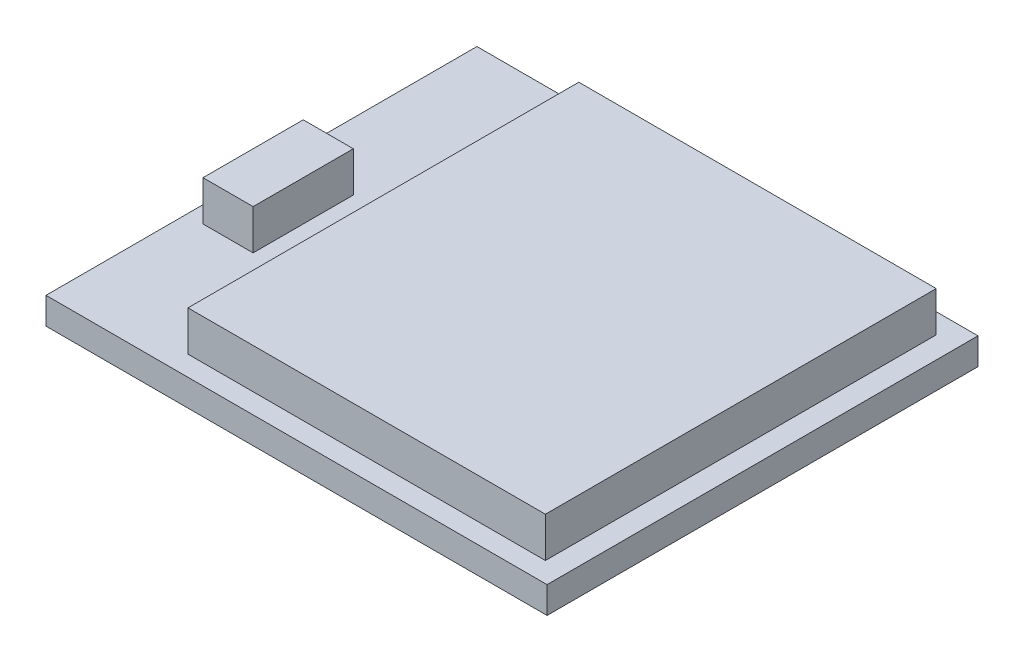
ISO-10303-21;
HEADER;
FILE_DESCRIPTION(('STEP AP214'),'2;1');
FILE_NAME('part.step','',(''),(''),'','','');
FILE_SCHEMA(('AUTOMOTIVE_DESIGN { 1 0 10303 214 1 1 1 1 }'));
ENDSEC;
DATA;
#1=APPLICATION_CONTEXT('core data for automotive mechanical design processes');
#2=APPLICATION_PROTOCOL_DEFINITION('international standard','automotive_design',2000,#1);
#3=PRODUCT_CONTEXT('',#1,'mechanical');
#4=PRODUCT('Part','Part','',(#3));
#5=PRODUCT_RELATED_PRODUCT_CATEGORY('part','',(#4));
#6=PRODUCT_DEFINITION_FORMATION('','',#4);
#7=PRODUCT_DEFINITION_CONTEXT('part definition',#1,'design');
#8=PRODUCT_DEFINITION('design','',#6,#7);
#9=PRODUCT_DEFINITION_SHAPE('','',#8);
#10=(LENGTH_UNIT() NAMED_UNIT(*) SI_UNIT(.MILLI.,.METRE.));
#11=(NAMED_UNIT(*) PLANE_ANGLE_UNIT() SI_UNIT($,.RADIAN.));
#12=(NAMED_UNIT(*) SI_UNIT($,.STERADIAN.) SOLID_ANGLE_UNIT());
#13=UNCERTAINTY_MEASURE_WITH_UNIT(LENGTH_MEASURE(1.E-05),#10,'distance_accuracy_value','');
#14=(GEOMETRIC_REPRESENTATION_CONTEXT(3) GLOBAL_UNCERTAINTY_ASSIGNED_CONTEXT((#13)) GLOBAL_UNIT_ASSIGNED_CONTEXT((#10,
#11,#12)) REPRESENTATION_CONTEXT('',''));
#15=CARTESIAN_POINT('',(0.,0.,0.));
#16=DIRECTION('',(0.,0.,1.));
#17=DIRECTION('',(1.,0.,0.));
#18=AXIS2_PLACEMENT_3D('',#15,#16,#17);
#19=CARTESIAN_POINT('',(0.,0.4,0.));
#20=DIRECTION('',(0.,1.,0.));
#21=DIRECTION('',(0.,0.,1.));
#22=AXIS2_PLACEMENT_3D('',#19,#20,#21);
#23=PLANE('',#22);
#24=DIRECTION('',(0.,0.,-1.));
#25=VECTOR('',#24,1.);
#26=CARTESIAN_POINT('',(6.85,0.4,-5.85));
#27=LINE('',#26,#25);
#28=CARTESIAN_POINT('',(6.85,0.4,5.85));
#29=VERTEX_POINT('',#28);
#30=CARTESIAN_POINT('',(6.85,0.4,-5.85));
#31=VERTEX_POINT('',#30);
#32=EDGE_CURVE('E65',#29,#31,#27,.T.);
#33=ORIENTED_EDGE('',*,*,#32,.F.);
#34=DIRECTION('',(1.,0.,0.));
#35=VECTOR('',#34,1.);
#36=CARTESIAN_POINT('',(-3.84999999999999,0.4,5.85));
#37=LINE('',#36,#35);
#38=CARTESIAN_POINT('',(-3.84999999999999,0.4,5.85));
#39=VERTEX_POINT('',#38);
#40=EDGE_CURVE('E175',#39,#29,#37,.T.);
#41=ORIENTED_EDGE('',*,*,#40,.F.);
#42=DIRECTION('',(0.,0.,1.));
#43=VECTOR('',#42,1.);
#44=CARTESIAN_POINT('',(-3.85,0.4,-5.85));
#45=LINE('',#44,#43);
#46=CARTESIAN_POINT('',(-3.85,0.4,-5.85));
#47=VERTEX_POINT('',#46);
#48=EDGE_CURVE('E181',#47,#39,#45,.T.);
#49=ORIENTED_EDGE('',*,*,#48,.F.);
#50=DIRECTION('',(-1.,0.,0.));
#51=VECTOR('',#50,1.);
#52=CARTESIAN_POINT('',(-3.85,0.4,-5.85));
#53=LINE('',#52,#51);
#54=EDGE_CURVE('E186',#31,#47,#53,.T.);
#55=ORIENTED_EDGE('',*,*,#54,.F.);
#56=EDGE_LOOP('',(#33,#41,#49,#55));
#57=FACE_BOUND('',#56,.T.);
#58=DIRECTION('',(0.,0.,-1.));
#59=VECTOR('',#58,1.);
#60=CARTESIAN_POINT('',(7.5,0.4,-6.45));
#61=LINE('',#60,#59);
#62=CARTESIAN_POINT('',(7.5,0.4,6.45));
#63=VERTEX_POINT('',#62);
#64=CARTESIAN_POINT('',(7.5,0.4,-6.45));
#65=VERTEX_POINT('',#64);
#66=EDGE_CURVE('E218',#63,#65,#61,.T.);
#67=ORIENTED_EDGE('',*,*,#66,.T.);
#68=DIRECTION('',(-1.,0.,0.));
#69=VECTOR('',#68,1.);
#70=CARTESIAN_POINT('',(-7.5,0.4,-6.45));
#71=LINE('',#70,#69);
#72=CARTESIAN_POINT('',(-7.5,0.4,-6.45));
#73=VERTEX_POINT('',#72);
#74=EDGE_CURVE('E222',#65,#73,#71,.T.);
#75=ORIENTED_EDGE('',*,*,#74,.T.);
#76=DIRECTION('',(0.,0.,1.));
#77=VECTOR('',#76,1.);
#78=CARTESIAN_POINT('',(-7.5,0.4,-6.45));
#79=LINE('',#78,#77);
#80=CARTESIAN_POINT('',(-7.5,0.4,6.45));
#81=VERTEX_POINT('',#80);
#82=EDGE_CURVE('E226',#73,#81,#79,.T.);
#83=ORIENTED_EDGE('',*,*,#82,.T.);
#84=DIRECTION('',(1.,0.,0.));
#85=VECTOR('',#84,1.);
#86=CARTESIAN_POINT('',(-7.5,0.4,6.45));
#87=LINE('',#86,#85);
#88=EDGE_CURVE('E229',#81,#63,#87,.T.);
#89=ORIENTED_EDGE('',*,*,#88,.T.);
#90=EDGE_LOOP('',(#67,#75,#83,#89));
#91=FACE_BOUND('',#90,.T.);
#92=DIRECTION('',(-1.,0.,0.));
#93=VECTOR('',#92,1.);
#94=CARTESIAN_POINT('',(-7.,0.4,-0.749999999999999));
#95=LINE('',#94,#93);
#96=CARTESIAN_POINT('',(-5.5,0.4,-0.749999999999999));
#97=VERTEX_POINT('',#96);
#98=CARTESIAN_POINT('',(-7.,0.4,-0.749999999999999));
#99=VERTEX_POINT('',#98);
#100=EDGE_CURVE('E169',#97,#99,#95,.T.);
#101=ORIENTED_EDGE('',*,*,#100,.F.);
#102=DIRECTION('',(0.,0.,-1.));
#103=VECTOR('',#102,1.);
#104=CARTESIAN_POINT('',(-5.5,0.4,-0.749999999999999));
#105=LINE('',#104,#103);
#106=CARTESIAN_POINT('',(-5.5,0.4,2.25));
#107=VERTEX_POINT('',#106);
#108=EDGE_CURVE('E161',#107,#97,#105,.T.);
#109=ORIENTED_EDGE('',*,*,#108,.F.);
#110=DIRECTION('',(1.,0.,0.));
#111=VECTOR('',#110,1.);
#112=CARTESIAN_POINT('',(-7.,0.4,2.25));
#113=LINE('',#112,#111);
#114=CARTESIAN_POINT('',(-7.,0.4,2.25));
#115=VERTEX_POINT('',#114);
#116=EDGE_CURVE('E138',#115,#107,#113,.T.);
#117=ORIENTED_EDGE('',*,*,#116,.F.);
#118=DIRECTION('',(0.,0.,1.));
#119=VECTOR('',#118,1.);
#120=CARTESIAN_POINT('',(-7.,0.4,-0.749999999999999));
#121=LINE('',#120,#119);
#122=EDGE_CURVE('E57',#99,#115,#121,.T.);
#123=ORIENTED_EDGE('',*,*,#122,.F.);
#124=EDGE_LOOP('',(#101,#109,#117,#123));
#125=FACE_BOUND('',#124,.T.);
#126=ADVANCED_FACE('F41',(#57,#91,#125),#23,.T.);
#127=CARTESIAN_POINT('',(7.5,0.4,-6.45));
#128=DIRECTION('',(-1.,0.,0.));
#129=DIRECTION('',(0.,0.,1.));
#130=AXIS2_PLACEMENT_3D('',#127,#128,#129);
#131=PLANE('',#130);
#132=DIRECTION('',(0.,0.,-1.));
#133=VECTOR('',#132,1.);
#134=CARTESIAN_POINT('',(7.5,-0.4,-6.45));
#135=LINE('',#134,#133);
#136=CARTESIAN_POINT('',(7.5,-0.4,6.45));
#137=VERTEX_POINT('',#136);
#138=CARTESIAN_POINT('',(7.5,-0.4,-6.45));
#139=VERTEX_POINT('',#138);
#140=EDGE_CURVE('E197',#137,#139,#135,.T.);
#141=ORIENTED_EDGE('',*,*,#140,.T.);
#142=DIRECTION('',(0.,-1.,0.));
#143=VECTOR('',#142,1.);
#144=CARTESIAN_POINT('',(7.5,0.4,-6.45));
#145=LINE('',#144,#143);
#146=EDGE_CURVE('E12',#65,#139,#145,.T.);
#147=ORIENTED_EDGE('',*,*,#146,.F.);
#148=ORIENTED_EDGE('',*,*,#66,.F.);
#149=DIRECTION('',(0.,-1.,0.));
#150=VECTOR('',#149,1.);
#151=CARTESIAN_POINT('',(7.5,0.4,6.45));
#152=LINE('',#151,#150);
#153=EDGE_CURVE('E232',#63,#137,#152,.T.);
#154=ORIENTED_EDGE('',*,*,#153,.T.);
#155=EDGE_LOOP('',(#141,#147,#148,#154));
#156=FACE_BOUND('',#155,.T.);
#157=ADVANCED_FACE('F43',(#156),#131,.F.);
#158=CARTESIAN_POINT('',(-7.5,0.4,-6.45));
#159=DIRECTION('',(0.,0.,1.));
#160=DIRECTION('',(1.,0.,0.));
#161=AXIS2_PLACEMENT_3D('',#158,#159,#160);
#162=PLANE('',#161);
#163=DIRECTION('',(-1.,0.,0.));
#164=VECTOR('',#163,1.);
#165=CARTESIAN_POINT('',(-7.5,-0.4,-6.45));
#166=LINE('',#165,#164);
#167=CARTESIAN_POINT('',(-7.5,-0.4,-6.45));
#168=VERTEX_POINT('',#167);
#169=EDGE_CURVE('E236',#139,#168,#166,.T.);
#170=ORIENTED_EDGE('',*,*,#169,.T.);
#171=DIRECTION('',(0.,-1.,0.));
#172=VECTOR('',#171,1.);
#173=CARTESIAN_POINT('',(-7.5,0.4,-6.45));
#174=LINE('',#173,#172);
#175=EDGE_CURVE('E50',#73,#168,#174,.T.);
#176=ORIENTED_EDGE('',*,*,#175,.F.);
#177=ORIENTED_EDGE('',*,*,#74,.F.);
#178=ORIENTED_EDGE('',*,*,#146,.T.);
#179=EDGE_LOOP('',(#170,#176,#177,#178));
#180=FACE_BOUND('',#179,.T.);
#181=ADVANCED_FACE('F272',(#180),#162,.F.);
#182=CARTESIAN_POINT('',(-7.5,0.4,-6.45));
#183=DIRECTION('',(1.,0.,0.));
#184=DIRECTION('',(0.,0.,-1.));
#185=AXIS2_PLACEMENT_3D('',#182,#183,#184);
#186=PLANE('',#185);
#187=DIRECTION('',(0.,0.,1.));
#188=VECTOR('',#187,1.);
#189=CARTESIAN_POINT('',(-7.5,-0.4,-6.45));
#190=LINE('',#189,#188);
#191=CARTESIAN_POINT('',(-7.5,-0.4,6.45));
#192=VERTEX_POINT('',#191);
#193=EDGE_CURVE('E239',#168,#192,#190,.T.);
#194=ORIENTED_EDGE('',*,*,#193,.T.);
#195=DIRECTION('',(0.,-1.,0.));
#196=VECTOR('',#195,1.);
#197=CARTESIAN_POINT('',(-7.5,0.4,6.45));
#198=LINE('',#197,#196);
#199=EDGE_CURVE('E247',#81,#192,#198,.T.);
#200=ORIENTED_EDGE('',*,*,#199,.F.);
#201=ORIENTED_EDGE('',*,*,#82,.F.);
#202=ORIENTED_EDGE('',*,*,#175,.T.);
#203=EDGE_LOOP('',(#194,#200,#201,#202));
#204=FACE_BOUND('',#203,.T.);
#205=ADVANCED_FACE('F256',(#204),#186,.F.);
#206=CARTESIAN_POINT('',(-7.5,0.4,6.45));
#207=DIRECTION('',(0.,0.,-1.));
#208=DIRECTION('',(-1.,0.,0.));
#209=AXIS2_PLACEMENT_3D('',#206,#207,#208);
#210=PLANE('',#209);
#211=DIRECTION('',(1.,0.,0.));
#212=VECTOR('',#211,1.);
#213=CARTESIAN_POINT('',(-7.5,-0.4,6.45));
#214=LINE('',#213,#212);
#215=EDGE_CURVE('E223',#192,#137,#214,.T.);
#216=ORIENTED_EDGE('',*,*,#215,.T.);
#217=ORIENTED_EDGE('',*,*,#153,.F.);
#218=ORIENTED_EDGE('',*,*,#88,.F.);
#219=ORIENTED_EDGE('',*,*,#199,.T.);
#220=EDGE_LOOP('',(#216,#217,#218,#219));
#221=FACE_BOUND('',#220,.T.);
#222=ADVANCED_FACE('F265',(#221),#210,.F.);
#223=CARTESIAN_POINT('',(0.,-0.4,0.));
#224=DIRECTION('',(0.,1.,0.));
#225=DIRECTION('',(0.,0.,1.));
#226=AXIS2_PLACEMENT_3D('',#223,#224,#225);
#227=PLANE('',#226);
#228=ORIENTED_EDGE('',*,*,#140,.F.);
#229=ORIENTED_EDGE('',*,*,#215,.F.);
#230=ORIENTED_EDGE('',*,*,#193,.F.);
#231=ORIENTED_EDGE('',*,*,#169,.F.);
#232=EDGE_LOOP('',(#228,#229,#230,#231));
#233=FACE_BOUND('',#232,.T.);
#234=ADVANCED_FACE('F262',(#233),#227,.F.);
#235=CARTESIAN_POINT('',(6.85,19.4549676757791,-5.85));
#236=DIRECTION('',(-1.,0.,0.));
#237=DIRECTION('',(0.,0.,1.));
#238=AXIS2_PLACEMENT_3D('',#235,#236,#237);
#239=PLANE('',#238);
#240=DIRECTION('',(0.,0.,-1.));
#241=VECTOR('',#240,1.);
#242=CARTESIAN_POINT('',(6.85,1.6,-5.85));
#243=LINE('',#242,#241);
#244=CARTESIAN_POINT('',(6.85,1.6,5.85));
#245=VERTEX_POINT('',#244);
#246=CARTESIAN_POINT('',(6.85,1.60000000000001,-5.85));
#247=VERTEX_POINT('',#246);
#248=EDGE_CURVE('E202',#245,#247,#243,.T.);
#249=ORIENTED_EDGE('',*,*,#248,.F.);
#250=DIRECTION('',(0.,-1.,0.));
#251=VECTOR('',#250,1.);
#252=CARTESIAN_POINT('',(6.85,19.4549676757791,5.85));
#253=LINE('',#252,#251);
#254=EDGE_CURVE('E154',#245,#29,#253,.T.);
#255=ORIENTED_EDGE('',*,*,#254,.T.);
#256=ORIENTED_EDGE('',*,*,#32,.T.);
#257=DIRECTION('',(0.,-1.,0.));
#258=VECTOR('',#257,1.);
#259=CARTESIAN_POINT('',(6.85,19.4549676757791,-5.85));
#260=LINE('',#259,#258);
#261=EDGE_CURVE('E190',#247,#31,#260,.T.);
#262=ORIENTED_EDGE('',*,*,#261,.F.);
#263=EDGE_LOOP('',(#249,#255,#256,#262));
#264=FACE_BOUND('',#263,.T.);
#265=ADVANCED_FACE('F289',(#264),#239,.F.);
#266=CARTESIAN_POINT('',(-3.85,19.4549676757791,-5.85));
#267=DIRECTION('',(0.,0.,1.));
#268=DIRECTION('',(1.,0.,0.));
#269=AXIS2_PLACEMENT_3D('',#266,#267,#268);
#270=PLANE('',#269);
#271=DIRECTION('',(-1.,0.,0.));
#272=VECTOR('',#271,1.);
#273=CARTESIAN_POINT('',(-3.85,1.6,-5.85));
#274=LINE('',#273,#272);
#275=CARTESIAN_POINT('',(-3.85,1.60000000000001,-5.85));
#276=VERTEX_POINT('',#275);
#277=EDGE_CURVE('E198',#247,#276,#274,.T.);
#278=ORIENTED_EDGE('',*,*,#277,.F.);
#279=ORIENTED_EDGE('',*,*,#261,.T.);
#280=ORIENTED_EDGE('',*,*,#54,.T.);
#281=DIRECTION('',(0.,-1.,0.));
#282=VECTOR('',#281,1.);
#283=CARTESIAN_POINT('',(-3.85,19.4549676757791,-5.85));
#284=LINE('',#283,#282);
#285=EDGE_CURVE('E185',#276,#47,#284,.T.);
#286=ORIENTED_EDGE('',*,*,#285,.F.);
#287=EDGE_LOOP('',(#278,#279,#280,#286));
#288=FACE_BOUND('',#287,.T.);
#289=ADVANCED_FACE('F305',(#288),#270,.F.);
#290=CARTESIAN_POINT('',(-3.85,19.4549676757791,-5.85));
#291=DIRECTION('',(1.,0.,0.));
#292=DIRECTION('',(0.,0.,-1.));
#293=AXIS2_PLACEMENT_3D('',#290,#291,#292);
#294=PLANE('',#293);
#295=DIRECTION('',(0.,0.,1.));
#296=VECTOR('',#295,1.);
#297=CARTESIAN_POINT('',(-3.85,1.6,-5.85));
#298=LINE('',#297,#296);
#299=CARTESIAN_POINT('',(-3.84999999999999,1.60000000000001,5.85));
#300=VERTEX_POINT('',#299);
#301=EDGE_CURVE('E193',#276,#300,#298,.T.);
#302=ORIENTED_EDGE('',*,*,#301,.F.);
#303=ORIENTED_EDGE('',*,*,#285,.T.);
#304=ORIENTED_EDGE('',*,*,#48,.T.);
#305=DIRECTION('',(0.,-1.,0.));
#306=VECTOR('',#305,1.);
#307=CARTESIAN_POINT('',(-3.84999999999999,19.4549676757791,5.85));
#308=LINE('',#307,#306);
#309=EDGE_CURVE('E180',#300,#39,#308,.T.);
#310=ORIENTED_EDGE('',*,*,#309,.F.);
#311=EDGE_LOOP('',(#302,#303,#304,#310));
#312=FACE_BOUND('',#311,.T.);
#313=ADVANCED_FACE('F312',(#312),#294,.F.);
#314=CARTESIAN_POINT('',(-3.84999999999999,19.4549676757791,5.85));
#315=DIRECTION('',(0.,0.,-1.));
#316=DIRECTION('',(-1.,0.,0.));
#317=AXIS2_PLACEMENT_3D('',#314,#315,#316);
#318=PLANE('',#317);
#319=DIRECTION('',(1.,0.,0.));
#320=VECTOR('',#319,1.);
#321=CARTESIAN_POINT('',(-3.84999999999999,1.6,5.85));
#322=LINE('',#321,#320);
#323=EDGE_CURVE('E179',#300,#245,#322,.T.);
#324=ORIENTED_EDGE('',*,*,#323,.F.);
#325=ORIENTED_EDGE('',*,*,#309,.T.);
#326=ORIENTED_EDGE('',*,*,#40,.T.);
#327=ORIENTED_EDGE('',*,*,#254,.F.);
#328=EDGE_LOOP('',(#324,#325,#326,#327));
#329=FACE_BOUND('',#328,.T.);
#330=ADVANCED_FACE('F320',(#329),#318,.F.);
#331=CARTESIAN_POINT('',(0.,1.6,0.));
#332=DIRECTION('',(0.,1.,0.));
#333=DIRECTION('',(0.,0.,1.));
#334=AXIS2_PLACEMENT_3D('',#331,#332,#333);
#335=PLANE('',#334);
#336=ORIENTED_EDGE('',*,*,#323,.T.);
#337=ORIENTED_EDGE('',*,*,#248,.T.);
#338=ORIENTED_EDGE('',*,*,#277,.T.);
#339=ORIENTED_EDGE('',*,*,#301,.T.);
#340=EDGE_LOOP('',(#336,#337,#338,#339));
#341=FACE_BOUND('',#340,.T.);
#342=ADVANCED_FACE('F285',(#341),#335,.T.);
#343=CARTESIAN_POINT('',(-5.5,6.95410196624969,-0.749999999999999));
#344=DIRECTION('',(-1.,0.,0.));
#345=DIRECTION('',(0.,0.,1.));
#346=AXIS2_PLACEMENT_3D('',#343,#344,#345);
#347=PLANE('',#346);
#348=DIRECTION('',(0.,0.,-1.));
#349=VECTOR('',#348,1.);
#350=CARTESIAN_POINT('',(-5.5,1.6,-0.749999999999999));
#351=LINE('',#350,#349);
#352=CARTESIAN_POINT('',(-5.5,1.6,2.25));
#353=VERTEX_POINT('',#352);
#354=CARTESIAN_POINT('',(-5.5,1.6,-0.749999999999999));
#355=VERTEX_POINT('',#354);
#356=EDGE_CURVE('E148',#353,#355,#351,.T.);
#357=ORIENTED_EDGE('',*,*,#356,.F.);
#358=DIRECTION('',(0.,-1.,0.));
#359=VECTOR('',#358,1.);
#360=CARTESIAN_POINT('',(-5.5,6.95410196624969,2.25));
#361=LINE('',#360,#359);
#362=EDGE_CURVE('E143',#353,#107,#361,.T.);
#363=ORIENTED_EDGE('',*,*,#362,.T.);
#364=ORIENTED_EDGE('',*,*,#108,.T.);
#365=DIRECTION('',(0.,-1.,0.));
#366=VECTOR('',#365,1.);
#367=CARTESIAN_POINT('',(-5.5,6.95410196624969,-0.749999999999999));
#368=LINE('',#367,#366);
#369=EDGE_CURVE('E166',#355,#97,#368,.T.);
#370=ORIENTED_EDGE('',*,*,#369,.F.);
#371=EDGE_LOOP('',(#357,#363,#364,#370));
#372=FACE_BOUND('',#371,.T.);
#373=ADVANCED_FACE('F335',(#372),#347,.F.);
#374=CARTESIAN_POINT('',(-7.,6.95410196624969,-0.749999999999999));
#375=DIRECTION('',(0.,0.,1.));
#376=DIRECTION('',(1.,0.,0.));
#377=AXIS2_PLACEMENT_3D('',#374,#375,#376);
#378=PLANE('',#377);
#379=DIRECTION('',(-1.,0.,0.));
#380=VECTOR('',#379,1.);
#381=CARTESIAN_POINT('',(-7.,1.6,-0.749999999999999));
#382=LINE('',#381,#380);
#383=CARTESIAN_POINT('',(-7.,1.6,-0.749999999999999));
#384=VERTEX_POINT('',#383);
#385=EDGE_CURVE('E152',#355,#384,#382,.T.);
#386=ORIENTED_EDGE('',*,*,#385,.F.);
#387=ORIENTED_EDGE('',*,*,#369,.T.);
#388=ORIENTED_EDGE('',*,*,#100,.T.);
#389=DIRECTION('',(0.,-1.,0.));
#390=VECTOR('',#389,1.);
#391=CARTESIAN_POINT('',(-7.,6.95410196624969,-0.749999999999999));
#392=LINE('',#391,#390);
#393=EDGE_CURVE('E170',#384,#99,#392,.T.);
#394=ORIENTED_EDGE('',*,*,#393,.F.);
#395=EDGE_LOOP('',(#386,#387,#388,#394));
#396=FACE_BOUND('',#395,.T.);
#397=ADVANCED_FACE('F342',(#396),#378,.F.);
#398=CARTESIAN_POINT('',(-7.,6.95410196624969,-0.749999999999999));
#399=DIRECTION('',(1.,0.,0.));
#400=DIRECTION('',(0.,0.,-1.));
#401=AXIS2_PLACEMENT_3D('',#398,#399,#400);
#402=PLANE('',#401);
#403=DIRECTION('',(0.,0.,1.));
#404=VECTOR('',#403,1.);
#405=CARTESIAN_POINT('',(-7.,1.6,-0.749999999999999));
#406=LINE('',#405,#404);
#407=CARTESIAN_POINT('',(-7.,1.6,2.25));
#408=VERTEX_POINT('',#407);
#409=EDGE_CURVE('E132',#384,#408,#406,.T.);
#410=ORIENTED_EDGE('',*,*,#409,.F.);
#411=ORIENTED_EDGE('',*,*,#393,.T.);
#412=ORIENTED_EDGE('',*,*,#122,.T.);
#413=DIRECTION('',(0.,-1.,0.));
#414=VECTOR('',#413,1.);
#415=CARTESIAN_POINT('',(-7.,6.95410196624969,2.25));
#416=LINE('',#415,#414);
#417=EDGE_CURVE('E128',#408,#115,#416,.T.);
#418=ORIENTED_EDGE('',*,*,#417,.F.);
#419=EDGE_LOOP('',(#410,#411,#412,#418));
#420=FACE_BOUND('',#419,.T.);
#421=ADVANCED_FACE('F130',(#420),#402,.F.);
#422=CARTESIAN_POINT('',(-7.,6.95410196624969,2.25));
#423=DIRECTION('',(0.,0.,-1.));
#424=DIRECTION('',(-1.,0.,0.));
#425=AXIS2_PLACEMENT_3D('',#422,#423,#424);
#426=PLANE('',#425);
#427=DIRECTION('',(1.,0.,0.));
#428=VECTOR('',#427,1.);
#429=CARTESIAN_POINT('',(-7.,1.6,2.25));
#430=LINE('',#429,#428);
#431=EDGE_CURVE('E141',#408,#353,#430,.T.);
#432=ORIENTED_EDGE('',*,*,#431,.F.);
#433=ORIENTED_EDGE('',*,*,#417,.T.);
#434=ORIENTED_EDGE('',*,*,#116,.T.);
#435=ORIENTED_EDGE('',*,*,#362,.F.);
#436=EDGE_LOOP('',(#432,#433,#434,#435));
#437=FACE_BOUND('',#436,.T.);
#438=ADVANCED_FACE('F142',(#437),#426,.F.);
#439=CARTESIAN_POINT('',(0.,1.6,0.));
#440=DIRECTION('',(0.,1.,0.));
#441=DIRECTION('',(0.,0.,1.));
#442=AXIS2_PLACEMENT_3D('',#439,#440,#441);
#443=PLANE('',#442);
#444=ORIENTED_EDGE('',*,*,#431,.T.);
#445=ORIENTED_EDGE('',*,*,#356,.T.);
#446=ORIENTED_EDGE('',*,*,#385,.T.);
#447=ORIENTED_EDGE('',*,*,#409,.T.);
#448=EDGE_LOOP('',(#444,#445,#446,#447));
#449=FACE_BOUND('',#448,.T.);
#450=ADVANCED_FACE('F151',(#449),#443,.T.);
#451=CLOSED_SHELL('',(#126,#157,#181,#205,#222,#234,#265,#289,#313,#330,#342,#373,#397,#421,
#438,#450));
#452=MANIFOLD_SOLID_BREP('B2',#451);
#453=ADVANCED_BREP_SHAPE_REPRESENTATION('',(#18,#452),#14);
#454=SHAPE_DEFINITION_REPRESENTATION(#9,#453);
ENDSEC;
END-ISO-10303-21;
